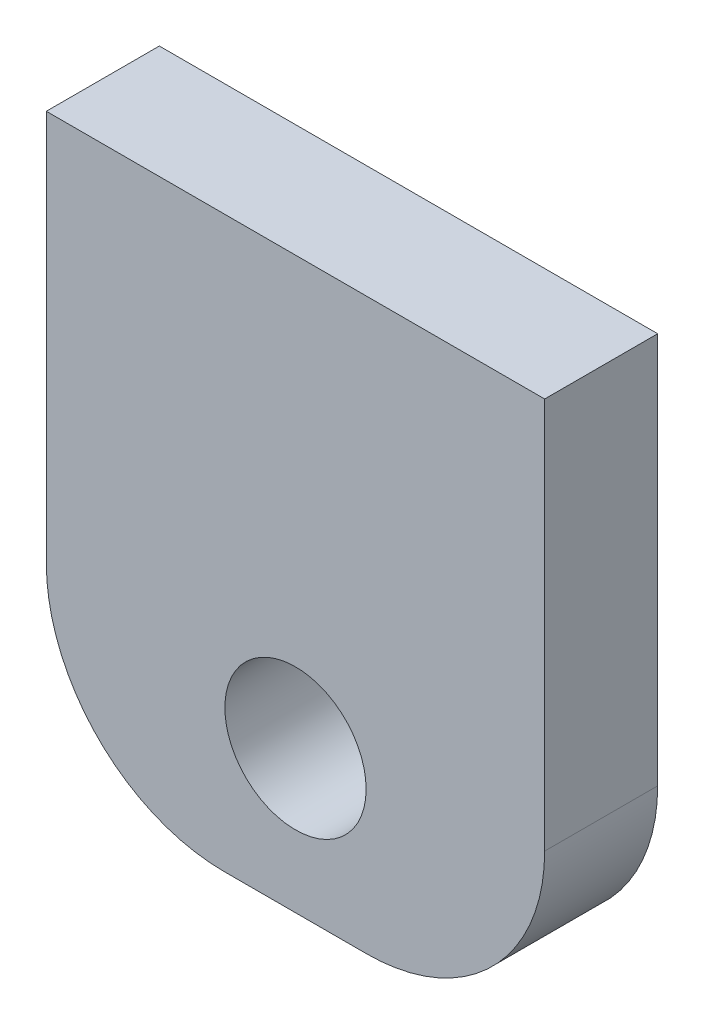
ISO-10303-21;
HEADER;
FILE_DESCRIPTION(('STEP AP214'),'2;1');
FILE_NAME('part.step','',(''),(''),'','','');
FILE_SCHEMA(('AUTOMOTIVE_DESIGN { 1 0 10303 214 1 1 1 1 }'));
ENDSEC;
DATA;
#1=APPLICATION_CONTEXT('core data for automotive mechanical design processes');
#2=APPLICATION_PROTOCOL_DEFINITION('international standard','automotive_design',2000,#1);
#3=PRODUCT_CONTEXT('',#1,'mechanical');
#4=PRODUCT('Part','Part','',(#3));
#5=PRODUCT_RELATED_PRODUCT_CATEGORY('part','',(#4));
#6=PRODUCT_DEFINITION_FORMATION('','',#4);
#7=PRODUCT_DEFINITION_CONTEXT('part definition',#1,'design');
#8=PRODUCT_DEFINITION('design','',#6,#7);
#9=PRODUCT_DEFINITION_SHAPE('','',#8);
#10=(LENGTH_UNIT() NAMED_UNIT(*) SI_UNIT(.MILLI.,.METRE.));
#11=(NAMED_UNIT(*) PLANE_ANGLE_UNIT() SI_UNIT($,.RADIAN.));
#12=(NAMED_UNIT(*) SI_UNIT($,.STERADIAN.) SOLID_ANGLE_UNIT());
#13=UNCERTAINTY_MEASURE_WITH_UNIT(LENGTH_MEASURE(1.E-05),#10,'distance_accuracy_value','');
#14=(GEOMETRIC_REPRESENTATION_CONTEXT(3) GLOBAL_UNCERTAINTY_ASSIGNED_CONTEXT((#13)) GLOBAL_UNIT_ASSIGNED_CONTEXT((#10,
#11,#12)) REPRESENTATION_CONTEXT('',''));
#15=CARTESIAN_POINT('',(0.,0.,0.));
#16=DIRECTION('',(0.,0.,1.));
#17=DIRECTION('',(1.,0.,0.));
#18=AXIS2_PLACEMENT_3D('',#15,#16,#17);
#19=CARTESIAN_POINT('',(0.,0.,6.35));
#20=DIRECTION('',(0.,0.,1.));
#21=DIRECTION('',(1.,0.,0.));
#22=AXIS2_PLACEMENT_3D('',#19,#20,#21);
#23=PLANE('',#22);
#24=DIRECTION('',(0.,-1.,0.));
#25=VECTOR('',#24,1.);
#26=CARTESIAN_POINT('',(0.,0.,6.35));
#27=LINE('',#26,#25);
#28=CARTESIAN_POINT('',(0.,0.,6.35));
#29=VERTEX_POINT('',#28);
#30=CARTESIAN_POINT('',(0.,-22.,6.35));
#31=VERTEX_POINT('',#30);
#32=EDGE_CURVE('E120',#29,#31,#27,.T.);
#33=ORIENTED_EDGE('',*,*,#32,.T.);
#34=CARTESIAN_POINT('',(10.,-22.,6.35));
#35=DIRECTION('',(0.,0.,1.));
#36=DIRECTION('',(1.,0.,0.));
#37=AXIS2_PLACEMENT_3D('',#34,#35,#36);
#38=CIRCLE('',#37,10.);
#39=CARTESIAN_POINT('',(10.,-32.,6.35));
#40=VERTEX_POINT('',#39);
#41=EDGE_CURVE('E41',#31,#40,#38,.T.);
#42=ORIENTED_EDGE('',*,*,#41,.T.);
#43=DIRECTION('',(1.,0.,0.));
#44=VECTOR('',#43,1.);
#45=CARTESIAN_POINT('',(0.,-32.,6.35));
#46=LINE('',#45,#44);
#47=CARTESIAN_POINT('',(18.,-32.,6.35));
#48=VERTEX_POINT('',#47);
#49=EDGE_CURVE('E94',#40,#48,#46,.T.);
#50=ORIENTED_EDGE('',*,*,#49,.T.);
#51=CARTESIAN_POINT('',(18.,-22.,6.35));
#52=DIRECTION('',(0.,0.,1.));
#53=DIRECTION('',(1.,0.,0.));
#54=AXIS2_PLACEMENT_3D('',#51,#52,#53);
#55=CIRCLE('',#54,10.);
#56=CARTESIAN_POINT('',(28.,-22.,6.35));
#57=VERTEX_POINT('',#56);
#58=EDGE_CURVE('E48',#48,#57,#55,.T.);
#59=ORIENTED_EDGE('',*,*,#58,.T.);
#60=DIRECTION('',(0.,1.,0.));
#61=VECTOR('',#60,1.);
#62=CARTESIAN_POINT('',(28.,0.,6.35));
#63=LINE('',#62,#61);
#64=CARTESIAN_POINT('',(28.,0.,6.35));
#65=VERTEX_POINT('',#64);
#66=EDGE_CURVE('E86',#57,#65,#63,.T.);
#67=ORIENTED_EDGE('',*,*,#66,.T.);
#68=DIRECTION('',(-1.,0.,0.));
#69=VECTOR('',#68,1.);
#70=CARTESIAN_POINT('',(0.,0.,6.35));
#71=LINE('',#70,#69);
#72=EDGE_CURVE('E90',#65,#29,#71,.T.);
#73=ORIENTED_EDGE('',*,*,#72,.T.);
#74=EDGE_LOOP('',(#33,#42,#50,#59,#67,#73));
#75=FACE_BOUND('',#74,.T.);
#76=CARTESIAN_POINT('',(14.,-24.,6.35));
#77=DIRECTION('',(0.,0.,1.));
#78=DIRECTION('',(1.,0.,0.));
#79=AXIS2_PLACEMENT_3D('',#76,#77,#78);
#80=CIRCLE('',#79,3.96875);
#81=CARTESIAN_POINT('',(17.96875,-24.,6.35));
#82=VERTEX_POINT('',#81);
#83=EDGE_CURVE('E115',#82,#82,#80,.T.);
#84=ORIENTED_EDGE('',*,*,#83,.F.);
#85=EDGE_LOOP('',(#84));
#86=FACE_BOUND('',#85,.T.);
#87=ADVANCED_FACE('F33',(#75,#86),#23,.T.);
#88=CARTESIAN_POINT('',(0.,0.,0.));
#89=DIRECTION('',(0.,0.,1.));
#90=DIRECTION('',(1.,0.,0.));
#91=AXIS2_PLACEMENT_3D('',#88,#89,#90);
#92=PLANE('',#91);
#93=DIRECTION('',(1.,0.,0.));
#94=VECTOR('',#93,1.);
#95=CARTESIAN_POINT('',(0.,-32.,0.));
#96=LINE('',#95,#94);
#97=CARTESIAN_POINT('',(10.,-32.,0.));
#98=VERTEX_POINT('',#97);
#99=CARTESIAN_POINT('',(18.,-32.,0.));
#100=VERTEX_POINT('',#99);
#101=EDGE_CURVE('E114',#98,#100,#96,.T.);
#102=ORIENTED_EDGE('',*,*,#101,.F.);
#103=CARTESIAN_POINT('',(10.,-22.,0.));
#104=DIRECTION('',(0.,0.,1.));
#105=DIRECTION('',(1.,0.,0.));
#106=AXIS2_PLACEMENT_3D('',#103,#104,#105);
#107=CIRCLE('',#106,10.);
#108=CARTESIAN_POINT('',(0.,-22.,0.));
#109=VERTEX_POINT('',#108);
#110=EDGE_CURVE('E128',#98,#109,#107,.F.);
#111=ORIENTED_EDGE('',*,*,#110,.T.);
#112=DIRECTION('',(0.,-1.,0.));
#113=VECTOR('',#112,1.);
#114=CARTESIAN_POINT('',(0.,0.,0.));
#115=LINE('',#114,#113);
#116=CARTESIAN_POINT('',(0.,0.,0.));
#117=VERTEX_POINT('',#116);
#118=EDGE_CURVE('E112',#117,#109,#115,.T.);
#119=ORIENTED_EDGE('',*,*,#118,.F.);
#120=DIRECTION('',(-1.,0.,0.));
#121=VECTOR('',#120,1.);
#122=CARTESIAN_POINT('',(0.,0.,0.));
#123=LINE('',#122,#121);
#124=CARTESIAN_POINT('',(28.,0.,0.));
#125=VERTEX_POINT('',#124);
#126=EDGE_CURVE('E119',#125,#117,#123,.T.);
#127=ORIENTED_EDGE('',*,*,#126,.F.);
#128=DIRECTION('',(0.,1.,0.));
#129=VECTOR('',#128,1.);
#130=CARTESIAN_POINT('',(28.,0.,0.));
#131=LINE('',#130,#129);
#132=CARTESIAN_POINT('',(28.,-22.,0.));
#133=VERTEX_POINT('',#132);
#134=EDGE_CURVE('E100',#133,#125,#131,.T.);
#135=ORIENTED_EDGE('',*,*,#134,.F.);
#136=CARTESIAN_POINT('',(18.,-22.,0.));
#137=DIRECTION('',(0.,0.,1.));
#138=DIRECTION('',(1.,0.,0.));
#139=AXIS2_PLACEMENT_3D('',#136,#137,#138);
#140=CIRCLE('',#139,10.);
#141=EDGE_CURVE('E126',#133,#100,#140,.F.);
#142=ORIENTED_EDGE('',*,*,#141,.T.);
#143=EDGE_LOOP('',(#102,#111,#119,#127,#135,#142));
#144=FACE_BOUND('',#143,.T.);
#145=CARTESIAN_POINT('',(14.,-24.,0.));
#146=DIRECTION('',(0.,0.,1.));
#147=DIRECTION('',(1.,0.,0.));
#148=AXIS2_PLACEMENT_3D('',#145,#146,#147);
#149=CIRCLE('',#148,3.96875);
#150=CARTESIAN_POINT('',(17.96875,-24.,0.));
#151=VERTEX_POINT('',#150);
#152=EDGE_CURVE('E147',#151,#151,#149,.T.);
#153=ORIENTED_EDGE('',*,*,#152,.T.);
#154=EDGE_LOOP('',(#153));
#155=FACE_BOUND('',#154,.T.);
#156=ADVANCED_FACE('F142',(#144,#155),#92,.F.);
#157=CARTESIAN_POINT('',(0.,0.,6.35));
#158=DIRECTION('',(1.,0.,0.));
#159=DIRECTION('',(0.,1.,0.));
#160=AXIS2_PLACEMENT_3D('',#157,#158,#159);
#161=PLANE('',#160);
#162=ORIENTED_EDGE('',*,*,#118,.T.);
#163=DIRECTION('',(0.,0.,-1.));
#164=VECTOR('',#163,1.);
#165=CARTESIAN_POINT('',(0.,-22.,6.35));
#166=LINE('',#165,#164);
#167=EDGE_CURVE('E56',#109,#31,#166,.F.);
#168=ORIENTED_EDGE('',*,*,#167,.T.);
#169=ORIENTED_EDGE('',*,*,#32,.F.);
#170=DIRECTION('',(0.,0.,-1.));
#171=VECTOR('',#170,1.);
#172=CARTESIAN_POINT('',(0.,0.,6.35));
#173=LINE('',#172,#171);
#174=EDGE_CURVE('E104',#29,#117,#173,.T.);
#175=ORIENTED_EDGE('',*,*,#174,.T.);
#176=EDGE_LOOP('',(#162,#168,#169,#175));
#177=FACE_BOUND('',#176,.T.);
#178=ADVANCED_FACE('F144',(#177),#161,.F.);
#179=CARTESIAN_POINT('',(0.,-32.,6.35));
#180=DIRECTION('',(0.,1.,0.));
#181=DIRECTION('',(0.,0.,1.));
#182=AXIS2_PLACEMENT_3D('',#179,#180,#181);
#183=PLANE('',#182);
#184=ORIENTED_EDGE('',*,*,#49,.F.);
#185=DIRECTION('',(0.,0.,-1.));
#186=VECTOR('',#185,1.);
#187=CARTESIAN_POINT('',(10.,-32.,6.35));
#188=LINE('',#187,#186);
#189=EDGE_CURVE('E123',#40,#98,#188,.T.);
#190=ORIENTED_EDGE('',*,*,#189,.T.);
#191=ORIENTED_EDGE('',*,*,#101,.T.);
#192=DIRECTION('',(0.,0.,-1.));
#193=VECTOR('',#192,1.);
#194=CARTESIAN_POINT('',(18.,-32.,6.35));
#195=LINE('',#194,#193);
#196=EDGE_CURVE('E103',#100,#48,#195,.F.);
#197=ORIENTED_EDGE('',*,*,#196,.T.);
#198=EDGE_LOOP('',(#184,#190,#191,#197));
#199=FACE_BOUND('',#198,.T.);
#200=ADVANCED_FACE('F136',(#199),#183,.F.);
#201=CARTESIAN_POINT('',(28.,0.,6.35));
#202=DIRECTION('',(-1.,0.,0.));
#203=DIRECTION('',(0.,-1.,0.));
#204=AXIS2_PLACEMENT_3D('',#201,#202,#203);
#205=PLANE('',#204);
#206=ORIENTED_EDGE('',*,*,#66,.F.);
#207=DIRECTION('',(0.,0.,-1.));
#208=VECTOR('',#207,1.);
#209=CARTESIAN_POINT('',(28.,-22.,6.35));
#210=LINE('',#209,#208);
#211=EDGE_CURVE('E11',#57,#133,#210,.T.);
#212=ORIENTED_EDGE('',*,*,#211,.T.);
#213=ORIENTED_EDGE('',*,*,#134,.T.);
#214=DIRECTION('',(0.,0.,-1.));
#215=VECTOR('',#214,1.);
#216=CARTESIAN_POINT('',(28.,0.,6.35));
#217=LINE('',#216,#215);
#218=EDGE_CURVE('E97',#65,#125,#217,.T.);
#219=ORIENTED_EDGE('',*,*,#218,.F.);
#220=EDGE_LOOP('',(#206,#212,#213,#219));
#221=FACE_BOUND('',#220,.T.);
#222=ADVANCED_FACE('F98',(#221),#205,.F.);
#223=CARTESIAN_POINT('',(0.,0.,6.35));
#224=DIRECTION('',(0.,-1.,0.));
#225=DIRECTION('',(0.,0.,-1.));
#226=AXIS2_PLACEMENT_3D('',#223,#224,#225);
#227=PLANE('',#226);
#228=ORIENTED_EDGE('',*,*,#126,.T.);
#229=ORIENTED_EDGE('',*,*,#174,.F.);
#230=ORIENTED_EDGE('',*,*,#72,.F.);
#231=ORIENTED_EDGE('',*,*,#218,.T.);
#232=EDGE_LOOP('',(#228,#229,#230,#231));
#233=FACE_BOUND('',#232,.T.);
#234=ADVANCED_FACE('F106',(#233),#227,.F.);
#235=CARTESIAN_POINT('',(14.,-24.,6.35));
#236=DIRECTION('',(0.,0.,-1.));
#237=DIRECTION('',(-1.,0.,0.));
#238=AXIS2_PLACEMENT_3D('',#235,#236,#237);
#239=CYLINDRICAL_SURFACE('',#238,3.96875);
#240=ORIENTED_EDGE('',*,*,#83,.T.);
#241=EDGE_LOOP('',(#240));
#242=FACE_BOUND('',#241,.T.);
#243=ORIENTED_EDGE('',*,*,#152,.F.);
#244=EDGE_LOOP('',(#243));
#245=FACE_BOUND('',#244,.T.);
#246=ADVANCED_FACE('F153',(#242,#245),#239,.F.);
#247=CARTESIAN_POINT('',(10.,-22.,6.35));
#248=DIRECTION('',(0.,0.,-1.));
#249=DIRECTION('',(-1.,0.,0.));
#250=AXIS2_PLACEMENT_3D('',#247,#248,#249);
#251=CYLINDRICAL_SURFACE('',#250,10.);
#252=ORIENTED_EDGE('',*,*,#41,.F.);
#253=ORIENTED_EDGE('',*,*,#167,.F.);
#254=ORIENTED_EDGE('',*,*,#110,.F.);
#255=ORIENTED_EDGE('',*,*,#189,.F.);
#256=EDGE_LOOP('',(#252,#253,#254,#255));
#257=FACE_BOUND('',#256,.T.);
#258=ADVANCED_FACE('F139',(#257),#251,.T.);
#259=CARTESIAN_POINT('',(18.,-22.,6.35));
#260=DIRECTION('',(0.,0.,-1.));
#261=DIRECTION('',(-1.,0.,0.));
#262=AXIS2_PLACEMENT_3D('',#259,#260,#261);
#263=CYLINDRICAL_SURFACE('',#262,10.);
#264=ORIENTED_EDGE('',*,*,#58,.F.);
#265=ORIENTED_EDGE('',*,*,#196,.F.);
#266=ORIENTED_EDGE('',*,*,#141,.F.);
#267=ORIENTED_EDGE('',*,*,#211,.F.);
#268=EDGE_LOOP('',(#264,#265,#266,#267));
#269=FACE_BOUND('',#268,.T.);
#270=ADVANCED_FACE('F35',(#269),#263,.T.);
#271=CLOSED_SHELL('',(#87,#156,#178,#200,#222,#234,#246,#258,#270));
#272=MANIFOLD_SOLID_BREP('B2',#271);
#273=ADVANCED_BREP_SHAPE_REPRESENTATION('',(#18,#272),#14);
#274=SHAPE_DEFINITION_REPRESENTATION(#9,#273);
ENDSEC;
END-ISO-10303-21;
